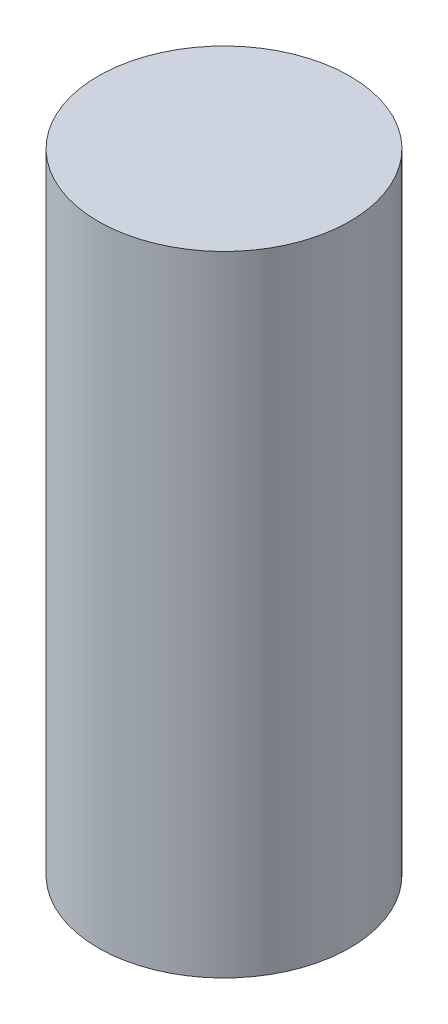
ISO-10303-21;
HEADER;
FILE_DESCRIPTION(('STEP AP214'),'2;1');
FILE_NAME('part.step','',(''),(''),'','','');
FILE_SCHEMA(('AUTOMOTIVE_DESIGN { 1 0 10303 214 1 1 1 1 }'));
ENDSEC;
DATA;
#1=APPLICATION_CONTEXT('core data for automotive mechanical design processes');
#2=APPLICATION_PROTOCOL_DEFINITION('international standard','automotive_design',2000,#1);
#3=PRODUCT_CONTEXT('',#1,'mechanical');
#4=PRODUCT('Part','Part','',(#3));
#5=PRODUCT_RELATED_PRODUCT_CATEGORY('part','',(#4));
#6=PRODUCT_DEFINITION_FORMATION('','',#4);
#7=PRODUCT_DEFINITION_CONTEXT('part definition',#1,'design');
#8=PRODUCT_DEFINITION('design','',#6,#7);
#9=PRODUCT_DEFINITION_SHAPE('','',#8);
#10=(LENGTH_UNIT() NAMED_UNIT(*) SI_UNIT(.MILLI.,.METRE.));
#11=(NAMED_UNIT(*) PLANE_ANGLE_UNIT() SI_UNIT($,.RADIAN.));
#12=(NAMED_UNIT(*) SI_UNIT($,.STERADIAN.) SOLID_ANGLE_UNIT());
#13=UNCERTAINTY_MEASURE_WITH_UNIT(LENGTH_MEASURE(1.E-05),#10,'distance_accuracy_value','');
#14=(GEOMETRIC_REPRESENTATION_CONTEXT(3) GLOBAL_UNCERTAINTY_ASSIGNED_CONTEXT((#13)) GLOBAL_UNIT_ASSIGNED_CONTEXT((#10,
#11,#12)) REPRESENTATION_CONTEXT('',''));
#15=CARTESIAN_POINT('',(0.,0.,0.));
#16=DIRECTION('',(0.,0.,1.));
#17=DIRECTION('',(1.,0.,0.));
#18=AXIS2_PLACEMENT_3D('',#15,#16,#17);
#19=CARTESIAN_POINT('',(0.,25.,0.));
#20=DIRECTION('',(0.,-1.,0.));
#21=DIRECTION('',(0.,0.,-1.));
#22=AXIS2_PLACEMENT_3D('',#19,#20,#21);
#23=CYLINDRICAL_SURFACE('',#22,5.);
#24=CARTESIAN_POINT('',(0.,25.,0.));
#25=DIRECTION('',(0.,1.,0.));
#26=DIRECTION('',(0.,0.,1.));
#27=AXIS2_PLACEMENT_3D('',#24,#25,#26);
#28=CIRCLE('',#27,5.);
#29=CARTESIAN_POINT('',(0.,25.,5.));
#30=VERTEX_POINT('',#29);
#31=EDGE_CURVE('E10',#30,#30,#28,.T.);
#32=ORIENTED_EDGE('',*,*,#31,.F.);
#33=EDGE_LOOP('',(#32));
#34=FACE_BOUND('',#33,.T.);
#35=CARTESIAN_POINT('',(0.,0.,0.));
#36=DIRECTION('',(0.,1.,0.));
#37=DIRECTION('',(0.,0.,1.));
#38=AXIS2_PLACEMENT_3D('',#35,#36,#37);
#39=CIRCLE('',#38,5.);
#40=CARTESIAN_POINT('',(0.,0.,5.));
#41=VERTEX_POINT('',#40);
#42=EDGE_CURVE('E34',#41,#41,#39,.T.);
#43=ORIENTED_EDGE('',*,*,#42,.T.);
#44=EDGE_LOOP('',(#43));
#45=FACE_BOUND('',#44,.T.);
#46=ADVANCED_FACE('F31',(#34,#45),#23,.T.);
#47=CARTESIAN_POINT('',(0.,25.,0.));
#48=DIRECTION('',(0.,1.,0.));
#49=DIRECTION('',(0.,0.,1.));
#50=AXIS2_PLACEMENT_3D('',#47,#48,#49);
#51=PLANE('',#50);
#52=ORIENTED_EDGE('',*,*,#31,.T.);
#53=EDGE_LOOP('',(#52));
#54=FACE_BOUND('',#53,.T.);
#55=ADVANCED_FACE('F46',(#54),#51,.T.);
#56=CARTESIAN_POINT('',(0.,0.,0.));
#57=DIRECTION('',(0.,1.,0.));
#58=DIRECTION('',(0.,0.,1.));
#59=AXIS2_PLACEMENT_3D('',#56,#57,#58);
#60=PLANE('',#59);
#61=ORIENTED_EDGE('',*,*,#42,.F.);
#62=EDGE_LOOP('',(#61));
#63=FACE_BOUND('',#62,.T.);
#64=ADVANCED_FACE('F44',(#63),#60,.F.);
#65=CLOSED_SHELL('',(#46,#55,#64));
#66=MANIFOLD_SOLID_BREP('B2',#65);
#67=ADVANCED_BREP_SHAPE_REPRESENTATION('',(#18,#66),#14);
#68=SHAPE_DEFINITION_REPRESENTATION(#9,#67);
ENDSEC;
END-ISO-10303-21;
